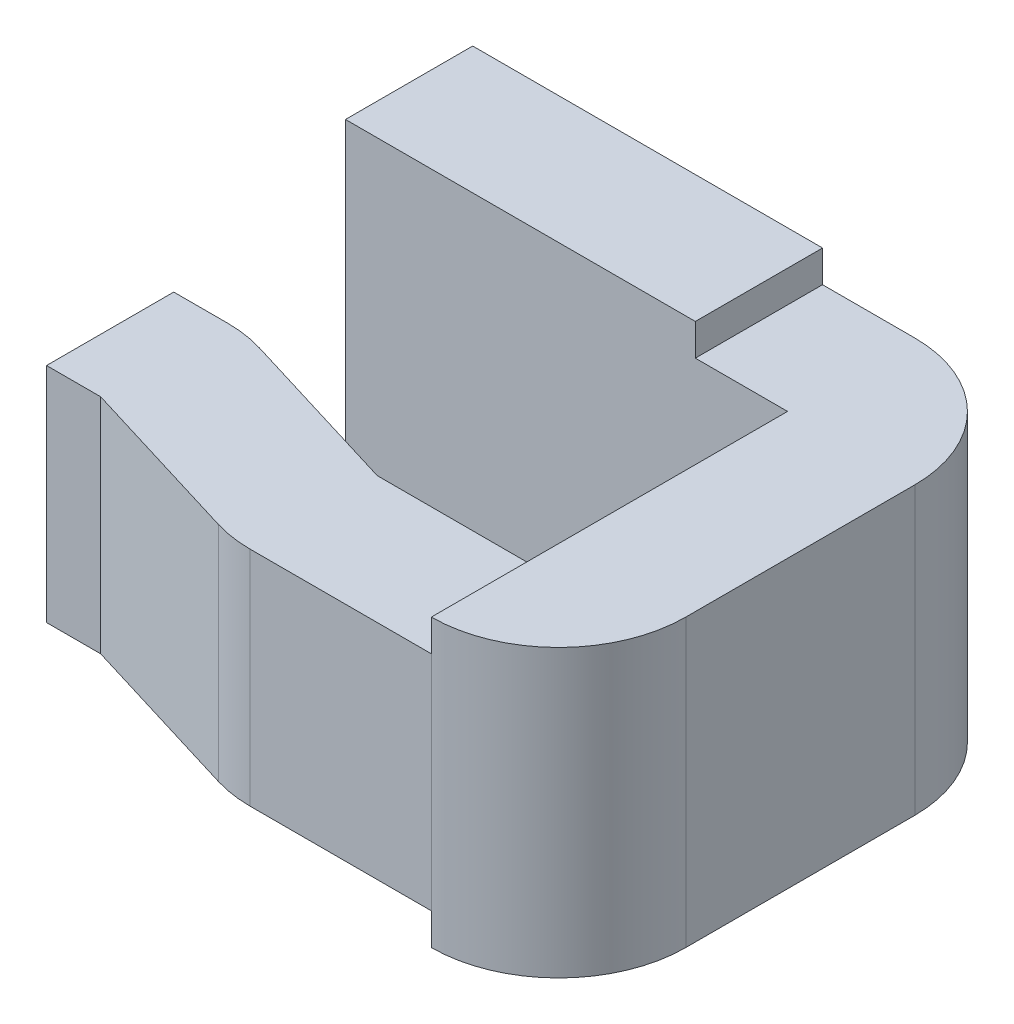
ISO-10303-21;
HEADER;
FILE_DESCRIPTION(('STEP AP214'),'2;1');
FILE_NAME('part.step','',(''),(''),'','','');
FILE_SCHEMA(('AUTOMOTIVE_DESIGN { 1 0 10303 214 1 1 1 1 }'));
ENDSEC;
DATA;
#1=APPLICATION_CONTEXT('core data for automotive mechanical design processes');
#2=APPLICATION_PROTOCOL_DEFINITION('international standard','automotive_design',2000,#1);
#3=PRODUCT_CONTEXT('',#1,'mechanical');
#4=PRODUCT('Part','Part','',(#3));
#5=PRODUCT_RELATED_PRODUCT_CATEGORY('part','',(#4));
#6=PRODUCT_DEFINITION_FORMATION('','',#4);
#7=PRODUCT_DEFINITION_CONTEXT('part definition',#1,'design');
#8=PRODUCT_DEFINITION('design','',#6,#7);
#9=PRODUCT_DEFINITION_SHAPE('','',#8);
#10=(LENGTH_UNIT() NAMED_UNIT(*) SI_UNIT(.MILLI.,.METRE.));
#11=(NAMED_UNIT(*) PLANE_ANGLE_UNIT() SI_UNIT($,.RADIAN.));
#12=(NAMED_UNIT(*) SI_UNIT($,.STERADIAN.) SOLID_ANGLE_UNIT());
#13=UNCERTAINTY_MEASURE_WITH_UNIT(LENGTH_MEASURE(1.E-05),#10,'distance_accuracy_value','');
#14=(GEOMETRIC_REPRESENTATION_CONTEXT(3) GLOBAL_UNCERTAINTY_ASSIGNED_CONTEXT((#13)) GLOBAL_UNIT_ASSIGNED_CONTEXT((#10,
#11,#12)) REPRESENTATION_CONTEXT('',''));
#15=CARTESIAN_POINT('',(0.,0.,0.));
#16=DIRECTION('',(0.,0.,1.));
#17=DIRECTION('',(1.,0.,0.));
#18=AXIS2_PLACEMENT_3D('',#15,#16,#17);
#19=CARTESIAN_POINT('',(1.39,0.55,0.92));
#20=DIRECTION('',(0.,0.,1.));
#21=DIRECTION('',(1.,0.,0.));
#22=AXIS2_PLACEMENT_3D('',#19,#20,#21);
#23=PLANE('',#22);
#24=DIRECTION('',(1.,0.,0.));
#25=VECTOR('',#24,1.);
#26=CARTESIAN_POINT('',(1.39,-0.35,0.92));
#27=LINE('',#26,#25);
#28=CARTESIAN_POINT('',(0.819829800590719,-0.35,0.92));
#29=VERTEX_POINT('',#28);
#30=CARTESIAN_POINT('',(1.39,-0.35,0.92));
#31=VERTEX_POINT('',#30);
#32=EDGE_CURVE('E231',#29,#31,#27,.T.);
#33=ORIENTED_EDGE('',*,*,#32,.F.);
#34=DIRECTION('',(0.,-1.,0.));
#35=VECTOR('',#34,1.);
#36=CARTESIAN_POINT('',(0.819829800590719,0.55,0.92));
#37=LINE('',#36,#35);
#38=CARTESIAN_POINT('',(0.819829800590719,0.35,0.92));
#39=VERTEX_POINT('',#38);
#40=EDGE_CURVE('E159',#39,#29,#37,.T.);
#41=ORIENTED_EDGE('',*,*,#40,.F.);
#42=DIRECTION('',(1.,0.,0.));
#43=VECTOR('',#42,1.);
#44=CARTESIAN_POINT('',(1.39,0.35,0.92));
#45=LINE('',#44,#43);
#46=CARTESIAN_POINT('',(1.39,0.35,0.92));
#47=VERTEX_POINT('',#46);
#48=EDGE_CURVE('E264',#39,#47,#45,.T.);
#49=ORIENTED_EDGE('',*,*,#48,.T.);
#50=DIRECTION('',(0.,-1.,0.));
#51=VECTOR('',#50,1.);
#52=CARTESIAN_POINT('',(1.39,0.55,0.92));
#53=LINE('',#52,#51);
#54=EDGE_CURVE('E163',#47,#31,#53,.T.);
#55=ORIENTED_EDGE('',*,*,#54,.T.);
#56=EDGE_LOOP('',(#33,#41,#49,#55));
#57=FACE_BOUND('',#56,.T.);
#58=ADVANCED_FACE('F39',(#57),#23,.F.);
#59=CARTESIAN_POINT('',(1.39,0.55,1.32));
#60=DIRECTION('',(0.,0.,-1.));
#61=DIRECTION('',(-1.,0.,0.));
#62=AXIS2_PLACEMENT_3D('',#59,#60,#61);
#63=PLANE('',#62);
#64=DIRECTION('',(-1.,0.,0.));
#65=VECTOR('',#64,1.);
#66=CARTESIAN_POINT('',(0.,-0.35,1.32));
#67=LINE('',#66,#65);
#68=CARTESIAN_POINT('',(1.39,-0.35,1.32));
#69=VERTEX_POINT('',#68);
#70=CARTESIAN_POINT('',(0.819829800590718,-0.35,1.32));
#71=VERTEX_POINT('',#70);
#72=EDGE_CURVE('E354',#69,#71,#67,.T.);
#73=ORIENTED_EDGE('',*,*,#72,.F.);
#74=DIRECTION('',(0.,-1.,0.));
#75=VECTOR('',#74,1.);
#76=CARTESIAN_POINT('',(1.39,0.55,1.32));
#77=LINE('',#76,#75);
#78=CARTESIAN_POINT('',(1.39,0.35,1.32));
#79=VERTEX_POINT('',#78);
#80=EDGE_CURVE('E126',#79,#69,#77,.T.);
#81=ORIENTED_EDGE('',*,*,#80,.F.);
#82=DIRECTION('',(-1.,0.,0.));
#83=VECTOR('',#82,1.);
#84=CARTESIAN_POINT('',(0.,0.35,1.32));
#85=LINE('',#84,#83);
#86=CARTESIAN_POINT('',(0.819829800590718,0.35,1.32));
#87=VERTEX_POINT('',#86);
#88=EDGE_CURVE('E236',#79,#87,#85,.T.);
#89=ORIENTED_EDGE('',*,*,#88,.T.);
#90=DIRECTION('',(0.,-1.,0.));
#91=VECTOR('',#90,1.);
#92=CARTESIAN_POINT('',(0.819829800590719,0.55,1.32));
#93=LINE('',#92,#91);
#94=EDGE_CURVE('E131',#87,#71,#93,.T.);
#95=ORIENTED_EDGE('',*,*,#94,.T.);
#96=EDGE_LOOP('',(#73,#81,#89,#95));
#97=FACE_BOUND('',#96,.T.);
#98=ADVANCED_FACE('F352',(#97),#63,.F.);
#99=CARTESIAN_POINT('',(0.819829800590719,0.55,0.92));
#100=DIRECTION('',(-0.291806643089871,0.,0.956477330127913));
#101=DIRECTION('',(0.956477330127913,0.,0.291806643089871));
#102=AXIS2_PLACEMENT_3D('',#99,#100,#101);
#103=PLANE('',#102);
#104=DIRECTION('',(0.956477330127913,0.,0.291806643089871));
#105=VECTOR('',#104,1.);
#106=CARTESIAN_POINT('',(0.819829800590719,-0.35,0.92));
#107=LINE('',#106,#105);
#108=CARTESIAN_POINT('',(0.286892856645232,-0.35,0.757409067948835));
#109=VERTEX_POINT('',#108);
#110=EDGE_CURVE('E227',#109,#29,#107,.T.);
#111=ORIENTED_EDGE('',*,*,#110,.F.);
#112=DIRECTION('',(0.,-1.,0.));
#113=VECTOR('',#112,1.);
#114=CARTESIAN_POINT('',(0.286892856645232,0.55,0.757409067948835));
#115=LINE('',#114,#113);
#116=CARTESIAN_POINT('',(0.286892856645232,0.35,0.757409067948835));
#117=VERTEX_POINT('',#116);
#118=EDGE_CURVE('E155',#117,#109,#115,.T.);
#119=ORIENTED_EDGE('',*,*,#118,.F.);
#120=DIRECTION('',(0.956477330127913,0.,0.291806643089871));
#121=VECTOR('',#120,1.);
#122=CARTESIAN_POINT('',(0.819829800590719,0.35,0.92));
#123=LINE('',#122,#121);
#124=EDGE_CURVE('E260',#117,#39,#123,.T.);
#125=ORIENTED_EDGE('',*,*,#124,.T.);
#126=ORIENTED_EDGE('',*,*,#40,.T.);
#127=EDGE_LOOP('',(#111,#119,#125,#126));
#128=FACE_BOUND('',#127,.T.);
#129=ADVANCED_FACE('F462',(#128),#103,.F.);
#130=CARTESIAN_POINT('',(0.170170199409284,0.55,1.14));
#131=DIRECTION('',(0.,-1.,0.));
#132=DIRECTION('',(0.,0.,-1.));
#133=AXIS2_PLACEMENT_3D('',#130,#131,#132);
#134=CYLINDRICAL_SURFACE('',#133,0.4);
#135=CARTESIAN_POINT('',(0.170170199409284,-0.35,1.14));
#136=DIRECTION('',(0.,-1.,0.));
#137=DIRECTION('',(1.,0.,0.));
#138=AXIS2_PLACEMENT_3D('',#135,#136,#137);
#139=CIRCLE('',#138,0.4);
#140=CARTESIAN_POINT('',(0.170170199409284,-0.35,0.74));
#141=VERTEX_POINT('',#140);
#142=EDGE_CURVE('E217',#141,#109,#139,.T.);
#143=ORIENTED_EDGE('',*,*,#142,.F.);
#144=DIRECTION('',(0.,-1.,0.));
#145=VECTOR('',#144,1.);
#146=CARTESIAN_POINT('',(0.170170199409284,0.55,0.74));
#147=LINE('',#146,#145);
#148=CARTESIAN_POINT('',(0.170170199409284,0.35,0.74));
#149=VERTEX_POINT('',#148);
#150=EDGE_CURVE('E151',#149,#141,#147,.T.);
#151=ORIENTED_EDGE('',*,*,#150,.F.);
#152=CARTESIAN_POINT('',(0.170170199409284,0.35,1.14));
#153=DIRECTION('',(0.,-1.,0.));
#154=DIRECTION('',(1.,0.,0.));
#155=AXIS2_PLACEMENT_3D('',#152,#153,#154);
#156=CIRCLE('',#155,0.4);
#157=EDGE_CURVE('E256',#149,#117,#156,.T.);
#158=ORIENTED_EDGE('',*,*,#157,.T.);
#159=ORIENTED_EDGE('',*,*,#118,.T.);
#160=EDGE_LOOP('',(#143,#151,#158,#159));
#161=FACE_BOUND('',#160,.T.);
#162=ADVANCED_FACE('F467',(#161),#134,.T.);
#163=CARTESIAN_POINT('',(0.170170199409284,0.55,0.74));
#164=DIRECTION('',(0.,0.,1.));
#165=DIRECTION('',(1.,0.,0.));
#166=AXIS2_PLACEMENT_3D('',#163,#164,#165);
#167=PLANE('',#166);
#168=DIRECTION('',(-1.,0.,0.));
#169=VECTOR('',#168,1.);
#170=CARTESIAN_POINT('',(0.,-0.35,0.74));
#171=LINE('',#170,#169);
#172=CARTESIAN_POINT('',(0.,-0.35,0.74));
#173=VERTEX_POINT('',#172);
#174=EDGE_CURVE('E472',#141,#173,#171,.T.);
#175=ORIENTED_EDGE('',*,*,#174,.T.);
#176=DIRECTION('',(0.,-1.,0.));
#177=VECTOR('',#176,1.);
#178=CARTESIAN_POINT('',(0.,0.55,0.74));
#179=LINE('',#178,#177);
#180=CARTESIAN_POINT('',(0.,0.35,0.74));
#181=VERTEX_POINT('',#180);
#182=EDGE_CURVE('E147',#181,#173,#179,.T.);
#183=ORIENTED_EDGE('',*,*,#182,.F.);
#184=DIRECTION('',(-1.,0.,0.));
#185=VECTOR('',#184,1.);
#186=CARTESIAN_POINT('',(0.,0.35,0.74));
#187=LINE('',#186,#185);
#188=EDGE_CURVE('E235',#149,#181,#187,.T.);
#189=ORIENTED_EDGE('',*,*,#188,.F.);
#190=ORIENTED_EDGE('',*,*,#150,.T.);
#191=EDGE_LOOP('',(#175,#183,#189,#190));
#192=FACE_BOUND('',#191,.T.);
#193=ADVANCED_FACE('F470',(#192),#167,.F.);
#194=CARTESIAN_POINT('',(0.,0.55,0.74));
#195=DIRECTION('',(1.,0.,0.));
#196=DIRECTION('',(0.,0.,-1.));
#197=AXIS2_PLACEMENT_3D('',#194,#195,#196);
#198=PLANE('',#197);
#199=DIRECTION('',(0.,0.,-1.));
#200=VECTOR('',#199,1.);
#201=CARTESIAN_POINT('',(0.,-0.35,1.32));
#202=LINE('',#201,#200);
#203=CARTESIAN_POINT('',(0.,-0.35,1.14));
#204=VERTEX_POINT('',#203);
#205=EDGE_CURVE('E220',#204,#173,#202,.T.);
#206=ORIENTED_EDGE('',*,*,#205,.F.);
#207=DIRECTION('',(0.,-1.,0.));
#208=VECTOR('',#207,1.);
#209=CARTESIAN_POINT('',(0.,0.55,1.14));
#210=LINE('',#209,#208);
#211=CARTESIAN_POINT('',(0.,0.35,1.14));
#212=VERTEX_POINT('',#211);
#213=EDGE_CURVE('E143',#212,#204,#210,.T.);
#214=ORIENTED_EDGE('',*,*,#213,.F.);
#215=DIRECTION('',(0.,0.,-1.));
#216=VECTOR('',#215,1.);
#217=CARTESIAN_POINT('',(0.,0.35,1.32));
#218=LINE('',#217,#216);
#219=EDGE_CURVE('E243',#212,#181,#218,.T.);
#220=ORIENTED_EDGE('',*,*,#219,.T.);
#221=ORIENTED_EDGE('',*,*,#182,.T.);
#222=EDGE_LOOP('',(#206,#214,#220,#221));
#223=FACE_BOUND('',#222,.T.);
#224=ADVANCED_FACE('F476',(#223),#198,.F.);
#225=CARTESIAN_POINT('',(0.170170199409284,0.55,1.14));
#226=DIRECTION('',(0.,0.,-1.));
#227=DIRECTION('',(-1.,0.,0.));
#228=AXIS2_PLACEMENT_3D('',#225,#226,#227);
#229=PLANE('',#228);
#230=DIRECTION('',(-1.,0.,0.));
#231=VECTOR('',#230,1.);
#232=CARTESIAN_POINT('',(0.170170199409284,-0.35,1.14));
#233=LINE('',#232,#231);
#234=CARTESIAN_POINT('',(0.170170199409284,-0.35,1.14));
#235=VERTEX_POINT('',#234);
#236=EDGE_CURVE('E212',#235,#204,#233,.T.);
#237=ORIENTED_EDGE('',*,*,#236,.F.);
#238=DIRECTION('',(0.,-1.,0.));
#239=VECTOR('',#238,1.);
#240=CARTESIAN_POINT('',(0.170170199409284,0.55,1.14));
#241=LINE('',#240,#239);
#242=CARTESIAN_POINT('',(0.170170199409284,0.35,1.14));
#243=VERTEX_POINT('',#242);
#244=EDGE_CURVE('E139',#243,#235,#241,.T.);
#245=ORIENTED_EDGE('',*,*,#244,.F.);
#246=DIRECTION('',(-1.,0.,0.));
#247=VECTOR('',#246,1.);
#248=CARTESIAN_POINT('',(0.170170199409284,0.35,1.14));
#249=LINE('',#248,#247);
#250=EDGE_CURVE('E252',#243,#212,#249,.T.);
#251=ORIENTED_EDGE('',*,*,#250,.T.);
#252=ORIENTED_EDGE('',*,*,#213,.T.);
#253=EDGE_LOOP('',(#237,#245,#251,#252));
#254=FACE_BOUND('',#253,.T.);
#255=ADVANCED_FACE('F479',(#254),#229,.F.);
#256=CARTESIAN_POINT('',(0.70310714335477,0.55,1.30259093205117));
#257=DIRECTION('',(0.291806643089871,0.,-0.956477330127913));
#258=DIRECTION('',(-0.956477330127913,0.,-0.291806643089871));
#259=AXIS2_PLACEMENT_3D('',#256,#257,#258);
#260=PLANE('',#259);
#261=DIRECTION('',(-0.956477330127913,0.,-0.291806643089871));
#262=VECTOR('',#261,1.);
#263=CARTESIAN_POINT('',(0.703107143354771,-0.35,1.30259093205117));
#264=LINE('',#263,#262);
#265=CARTESIAN_POINT('',(0.70310714335477,-0.35,1.30259093205117));
#266=VERTEX_POINT('',#265);
#267=EDGE_CURVE('E204',#266,#235,#264,.T.);
#268=ORIENTED_EDGE('',*,*,#267,.F.);
#269=DIRECTION('',(0.,-1.,0.));
#270=VECTOR('',#269,1.);
#271=CARTESIAN_POINT('',(0.70310714335477,0.55,1.30259093205117));
#272=LINE('',#271,#270);
#273=CARTESIAN_POINT('',(0.70310714335477,0.35,1.30259093205117));
#274=VERTEX_POINT('',#273);
#275=EDGE_CURVE('E135',#274,#266,#272,.T.);
#276=ORIENTED_EDGE('',*,*,#275,.F.);
#277=DIRECTION('',(-0.956477330127913,0.,-0.291806643089871));
#278=VECTOR('',#277,1.);
#279=CARTESIAN_POINT('',(0.70310714335477,0.35,1.30259093205117));
#280=LINE('',#279,#278);
#281=EDGE_CURVE('E201',#274,#243,#280,.T.);
#282=ORIENTED_EDGE('',*,*,#281,.T.);
#283=ORIENTED_EDGE('',*,*,#244,.T.);
#284=EDGE_LOOP('',(#268,#276,#282,#283));
#285=FACE_BOUND('',#284,.T.);
#286=ADVANCED_FACE('F200',(#285),#260,.F.);
#287=CARTESIAN_POINT('',(0.819829800590719,0.55,0.92));
#288=DIRECTION('',(0.,-1.,0.));
#289=DIRECTION('',(0.,0.,-1.));
#290=AXIS2_PLACEMENT_3D('',#287,#288,#289);
#291=CYLINDRICAL_SURFACE('',#290,0.4);
#292=CARTESIAN_POINT('',(0.819829800590719,-0.35,0.92));
#293=DIRECTION('',(0.,-1.,0.));
#294=DIRECTION('',(1.,0.,0.));
#295=AXIS2_PLACEMENT_3D('',#292,#293,#294);
#296=CIRCLE('',#295,0.4);
#297=EDGE_CURVE('E11',#71,#266,#296,.T.);
#298=ORIENTED_EDGE('',*,*,#297,.F.);
#299=ORIENTED_EDGE('',*,*,#94,.F.);
#300=CARTESIAN_POINT('',(0.819829800590719,0.35,0.92));
#301=DIRECTION('',(0.,-1.,0.));
#302=DIRECTION('',(1.,0.,0.));
#303=AXIS2_PLACEMENT_3D('',#300,#301,#302);
#304=CIRCLE('',#303,0.4);
#305=EDGE_CURVE('E48',#87,#274,#304,.T.);
#306=ORIENTED_EDGE('',*,*,#305,.T.);
#307=ORIENTED_EDGE('',*,*,#275,.T.);
#308=EDGE_LOOP('',(#298,#299,#306,#307));
#309=FACE_BOUND('',#308,.T.);
#310=ADVANCED_FACE('F187',(#309),#291,.T.);
#311=CARTESIAN_POINT('',(1.1,-0.45,1.32));
#312=DIRECTION('',(0.,-1.,0.));
#313=DIRECTION('',(1.,0.,0.));
#314=AXIS2_PLACEMENT_3D('',#311,#312,#313);
#315=PLANE('',#314);
#316=CARTESIAN_POINT('',(1.39,-0.45,0.92));
#317=DIRECTION('',(0.,-1.,0.));
#318=DIRECTION('',(1.,0.,0.));
#319=AXIS2_PLACEMENT_3D('',#316,#317,#318);
#320=CIRCLE('',#319,0.4);
#321=CARTESIAN_POINT('',(1.79,-0.45,0.92));
#322=VERTEX_POINT('',#321);
#323=CARTESIAN_POINT('',(1.39,-0.45,1.32));
#324=VERTEX_POINT('',#323);
#325=EDGE_CURVE('E289',#322,#324,#320,.T.);
#326=ORIENTED_EDGE('',*,*,#325,.T.);
#327=DIRECTION('',(0.,0.,-1.));
#328=VECTOR('',#327,1.);
#329=CARTESIAN_POINT('',(1.39,-0.45,0.2));
#330=LINE('',#329,#328);
#331=CARTESIAN_POINT('',(1.39,-0.45,0.2));
#332=VERTEX_POINT('',#331);
#333=EDGE_CURVE('E293',#324,#332,#330,.T.);
#334=ORIENTED_EDGE('',*,*,#333,.T.);
#335=DIRECTION('',(-1.,0.,0.));
#336=VECTOR('',#335,1.);
#337=CARTESIAN_POINT('',(0.,-0.45,0.2));
#338=LINE('',#337,#336);
#339=CARTESIAN_POINT('',(1.1,-0.45,0.2));
#340=VERTEX_POINT('',#339);
#341=EDGE_CURVE('E297',#332,#340,#338,.T.);
#342=ORIENTED_EDGE('',*,*,#341,.T.);
#343=DIRECTION('',(0.,0.,-1.));
#344=VECTOR('',#343,1.);
#345=CARTESIAN_POINT('',(1.1,-0.45,1.32));
#346=LINE('',#345,#344);
#347=CARTESIAN_POINT('',(1.1,-0.45,-0.2));
#348=VERTEX_POINT('',#347);
#349=EDGE_CURVE('E273',#340,#348,#346,.T.);
#350=ORIENTED_EDGE('',*,*,#349,.T.);
#351=DIRECTION('',(-1.,0.,0.));
#352=VECTOR('',#351,1.);
#353=CARTESIAN_POINT('',(1.1,-0.45,-0.2));
#354=LINE('',#353,#352);
#355=CARTESIAN_POINT('',(1.39,-0.45,-0.2));
#356=VERTEX_POINT('',#355);
#357=EDGE_CURVE('E270',#356,#348,#354,.T.);
#358=ORIENTED_EDGE('',*,*,#357,.F.);
#359=CARTESIAN_POINT('',(1.39,-0.45,0.2));
#360=DIRECTION('',(0.,-1.,0.));
#361=DIRECTION('',(1.,0.,0.));
#362=AXIS2_PLACEMENT_3D('',#359,#360,#361);
#363=CIRCLE('',#362,0.4);
#364=CARTESIAN_POINT('',(1.79,-0.45,0.2));
#365=VERTEX_POINT('',#364);
#366=EDGE_CURVE('E281',#356,#365,#363,.T.);
#367=ORIENTED_EDGE('',*,*,#366,.T.);
#368=DIRECTION('',(0.,0.,1.));
#369=VECTOR('',#368,1.);
#370=CARTESIAN_POINT('',(1.79,-0.45,0.2));
#371=LINE('',#370,#369);
#372=EDGE_CURVE('E285',#365,#322,#371,.T.);
#373=ORIENTED_EDGE('',*,*,#372,.T.);
#374=EDGE_LOOP('',(#326,#334,#342,#350,#358,#367,#373));
#375=FACE_BOUND('',#374,.T.);
#376=ADVANCED_FACE('F428',(#375),#315,.T.);
#377=CARTESIAN_POINT('',(0.,0.55,0.2));
#378=DIRECTION('',(0.,0.,-1.));
#379=DIRECTION('',(-1.,0.,0.));
#380=AXIS2_PLACEMENT_3D('',#377,#378,#379);
#381=PLANE('',#380);
#382=DIRECTION('',(0.,-1.,0.));
#383=VECTOR('',#382,1.);
#384=CARTESIAN_POINT('',(1.1,0.55,0.2));
#385=LINE('',#384,#383);
#386=CARTESIAN_POINT('',(1.1,-0.55,0.2));
#387=VERTEX_POINT('',#386);
#388=EDGE_CURVE('E277',#340,#387,#385,.T.);
#389=ORIENTED_EDGE('',*,*,#388,.F.);
#390=ORIENTED_EDGE('',*,*,#341,.F.);
#391=DIRECTION('',(0.,-1.,0.));
#392=VECTOR('',#391,1.);
#393=CARTESIAN_POINT('',(1.39,0.55,0.2));
#394=LINE('',#393,#392);
#395=CARTESIAN_POINT('',(1.39,0.45,0.2));
#396=VERTEX_POINT('',#395);
#397=EDGE_CURVE('E167',#396,#332,#394,.T.);
#398=ORIENTED_EDGE('',*,*,#397,.F.);
#399=DIRECTION('',(-1.,0.,0.));
#400=VECTOR('',#399,1.);
#401=CARTESIAN_POINT('',(0.,0.45,0.2));
#402=LINE('',#401,#400);
#403=CARTESIAN_POINT('',(1.1,0.45,0.2));
#404=VERTEX_POINT('',#403);
#405=EDGE_CURVE('E104',#396,#404,#402,.T.);
#406=ORIENTED_EDGE('',*,*,#405,.T.);
#407=DIRECTION('',(0.,1.,0.));
#408=VECTOR('',#407,1.);
#409=CARTESIAN_POINT('',(1.1,0.55,0.2));
#410=LINE('',#409,#408);
#411=CARTESIAN_POINT('',(1.1,0.55,0.2));
#412=VERTEX_POINT('',#411);
#413=EDGE_CURVE('E310',#404,#412,#410,.T.);
#414=ORIENTED_EDGE('',*,*,#413,.T.);
#415=DIRECTION('',(1.,0.,0.));
#416=VECTOR('',#415,1.);
#417=CARTESIAN_POINT('',(0.,0.55,0.2));
#418=LINE('',#417,#416);
#419=CARTESIAN_POINT('',(0.,0.55,0.2));
#420=VERTEX_POINT('',#419);
#421=EDGE_CURVE('E330',#420,#412,#418,.T.);
#422=ORIENTED_EDGE('',*,*,#421,.F.);
#423=DIRECTION('',(0.,-1.,0.));
#424=VECTOR('',#423,1.);
#425=CARTESIAN_POINT('',(0.,0.55,0.2));
#426=LINE('',#425,#424);
#427=CARTESIAN_POINT('',(0.,-0.55,0.2));
#428=VERTEX_POINT('',#427);
#429=EDGE_CURVE('E171',#420,#428,#426,.T.);
#430=ORIENTED_EDGE('',*,*,#429,.T.);
#431=DIRECTION('',(1.,0.,0.));
#432=VECTOR('',#431,1.);
#433=CARTESIAN_POINT('',(0.,-0.55,0.2));
#434=LINE('',#433,#432);
#435=EDGE_CURVE('E91',#428,#387,#434,.T.);
#436=ORIENTED_EDGE('',*,*,#435,.T.);
#437=EDGE_LOOP('',(#389,#390,#398,#406,#414,#422,#430,#436));
#438=FACE_BOUND('',#437,.T.);
#439=ADVANCED_FACE('F425',(#438),#381,.F.);
#440=CARTESIAN_POINT('',(1.39,0.55,0.2));
#441=DIRECTION('',(1.,0.,0.));
#442=DIRECTION('',(0.,0.,-1.));
#443=AXIS2_PLACEMENT_3D('',#440,#441,#442);
#444=PLANE('',#443);
#445=ORIENTED_EDGE('',*,*,#333,.F.);
#446=DIRECTION('',(0.,1.,0.));
#447=VECTOR('',#446,1.);
#448=CARTESIAN_POINT('',(1.39,-0.35,1.32));
#449=LINE('',#448,#447);
#450=EDGE_CURVE('E345',#324,#69,#449,.T.);
#451=ORIENTED_EDGE('',*,*,#450,.T.);
#452=DIRECTION('',(0.,0.,-1.));
#453=VECTOR('',#452,1.);
#454=CARTESIAN_POINT('',(1.39,-0.35,1.32));
#455=LINE('',#454,#453);
#456=EDGE_CURVE('E213',#69,#31,#455,.T.);
#457=ORIENTED_EDGE('',*,*,#456,.T.);
#458=ORIENTED_EDGE('',*,*,#54,.F.);
#459=DIRECTION('',(0.,0.,-1.));
#460=VECTOR('',#459,1.);
#461=CARTESIAN_POINT('',(1.39,0.35,1.32));
#462=LINE('',#461,#460);
#463=EDGE_CURVE('E239',#79,#47,#462,.T.);
#464=ORIENTED_EDGE('',*,*,#463,.F.);
#465=CARTESIAN_POINT('',(1.39,0.45,1.32));
#466=VERTEX_POINT('',#465);
#467=EDGE_CURVE('E127',#466,#79,#77,.T.);
#468=ORIENTED_EDGE('',*,*,#467,.F.);
#469=DIRECTION('',(0.,0.,-1.));
#470=VECTOR('',#469,1.);
#471=CARTESIAN_POINT('',(1.39,0.45,0.2));
#472=LINE('',#471,#470);
#473=EDGE_CURVE('E110',#466,#396,#472,.T.);
#474=ORIENTED_EDGE('',*,*,#473,.T.);
#475=ORIENTED_EDGE('',*,*,#397,.T.);
#476=EDGE_LOOP('',(#445,#451,#457,#458,#464,#468,#474,#475));
#477=FACE_BOUND('',#476,.T.);
#478=ADVANCED_FACE('F417',(#477),#444,.F.);
#479=CARTESIAN_POINT('',(1.39,0.55,0.92));
#480=DIRECTION('',(0.,-1.,0.));
#481=DIRECTION('',(0.,0.,-1.));
#482=AXIS2_PLACEMENT_3D('',#479,#480,#481);
#483=CYLINDRICAL_SURFACE('',#482,0.4);
#484=ORIENTED_EDGE('',*,*,#325,.F.);
#485=DIRECTION('',(0.,-1.,0.));
#486=VECTOR('',#485,1.);
#487=CARTESIAN_POINT('',(1.79,0.55,0.92));
#488=LINE('',#487,#486);
#489=CARTESIAN_POINT('',(1.79,0.45,0.92));
#490=VERTEX_POINT('',#489);
#491=EDGE_CURVE('E122',#490,#322,#488,.T.);
#492=ORIENTED_EDGE('',*,*,#491,.F.);
#493=CARTESIAN_POINT('',(1.39,0.45,0.92));
#494=DIRECTION('',(0.,-1.,0.));
#495=DIRECTION('',(1.,0.,0.));
#496=AXIS2_PLACEMENT_3D('',#493,#494,#495);
#497=CIRCLE('',#496,0.4);
#498=EDGE_CURVE('E322',#490,#466,#497,.T.);
#499=ORIENTED_EDGE('',*,*,#498,.T.);
#500=ORIENTED_EDGE('',*,*,#467,.T.);
#501=ORIENTED_EDGE('',*,*,#80,.T.);
#502=ORIENTED_EDGE('',*,*,#450,.F.);
#503=EDGE_LOOP('',(#484,#492,#499,#500,#501,#502));
#504=FACE_BOUND('',#503,.T.);
#505=ADVANCED_FACE('F342',(#504),#483,.T.);
#506=CARTESIAN_POINT('',(1.79,0.55,0.2));
#507=DIRECTION('',(-1.,0.,0.));
#508=DIRECTION('',(0.,0.,1.));
#509=AXIS2_PLACEMENT_3D('',#506,#507,#508);
#510=PLANE('',#509);
#511=ORIENTED_EDGE('',*,*,#372,.F.);
#512=DIRECTION('',(0.,-1.,0.));
#513=VECTOR('',#512,1.);
#514=CARTESIAN_POINT('',(1.79,0.55,0.2));
#515=LINE('',#514,#513);
#516=CARTESIAN_POINT('',(1.79,0.45,0.2));
#517=VERTEX_POINT('',#516);
#518=EDGE_CURVE('E118',#517,#365,#515,.T.);
#519=ORIENTED_EDGE('',*,*,#518,.F.);
#520=DIRECTION('',(0.,0.,1.));
#521=VECTOR('',#520,1.);
#522=CARTESIAN_POINT('',(1.79,0.45,0.2));
#523=LINE('',#522,#521);
#524=EDGE_CURVE('E318',#517,#490,#523,.T.);
#525=ORIENTED_EDGE('',*,*,#524,.T.);
#526=ORIENTED_EDGE('',*,*,#491,.T.);
#527=EDGE_LOOP('',(#511,#519,#525,#526));
#528=FACE_BOUND('',#527,.T.);
#529=ADVANCED_FACE('F439',(#528),#510,.F.);
#530=CARTESIAN_POINT('',(1.39,0.55,0.2));
#531=DIRECTION('',(0.,-1.,0.));
#532=DIRECTION('',(0.,0.,-1.));
#533=AXIS2_PLACEMENT_3D('',#530,#531,#532);
#534=CYLINDRICAL_SURFACE('',#533,0.4);
#535=ORIENTED_EDGE('',*,*,#366,.F.);
#536=DIRECTION('',(0.,-1.,0.));
#537=VECTOR('',#536,1.);
#538=CARTESIAN_POINT('',(1.39,0.55,-0.2));
#539=LINE('',#538,#537);
#540=CARTESIAN_POINT('',(1.39,0.45,-0.2));
#541=VERTEX_POINT('',#540);
#542=EDGE_CURVE('E98',#541,#356,#539,.T.);
#543=ORIENTED_EDGE('',*,*,#542,.F.);
#544=CARTESIAN_POINT('',(1.39,0.45,0.2));
#545=DIRECTION('',(0.,-1.,0.));
#546=DIRECTION('',(1.,0.,0.));
#547=AXIS2_PLACEMENT_3D('',#544,#545,#546);
#548=CIRCLE('',#547,0.4);
#549=EDGE_CURVE('E314',#541,#517,#548,.T.);
#550=ORIENTED_EDGE('',*,*,#549,.T.);
#551=ORIENTED_EDGE('',*,*,#518,.T.);
#552=EDGE_LOOP('',(#535,#543,#550,#551));
#553=FACE_BOUND('',#552,.T.);
#554=ADVANCED_FACE('F436',(#553),#534,.T.);
#555=CARTESIAN_POINT('',(0.,0.55,-0.2));
#556=DIRECTION('',(0.,0.,1.));
#557=DIRECTION('',(1.,0.,0.));
#558=AXIS2_PLACEMENT_3D('',#555,#556,#557);
#559=PLANE('',#558);
#560=DIRECTION('',(0.,-1.,0.));
#561=VECTOR('',#560,1.);
#562=CARTESIAN_POINT('',(1.1,-0.55,-0.2));
#563=LINE('',#562,#561);
#564=CARTESIAN_POINT('',(1.1,-0.55,-0.2));
#565=VERTEX_POINT('',#564);
#566=EDGE_CURVE('E85',#348,#565,#563,.T.);
#567=ORIENTED_EDGE('',*,*,#566,.T.);
#568=DIRECTION('',(-1.,0.,0.));
#569=VECTOR('',#568,1.);
#570=CARTESIAN_POINT('',(0.,-0.55,-0.2));
#571=LINE('',#570,#569);
#572=CARTESIAN_POINT('',(0.,-0.55,-0.2));
#573=VERTEX_POINT('',#572);
#574=EDGE_CURVE('E77',#565,#573,#571,.T.);
#575=ORIENTED_EDGE('',*,*,#574,.T.);
#576=DIRECTION('',(0.,-1.,0.));
#577=VECTOR('',#576,1.);
#578=CARTESIAN_POINT('',(0.,0.55,-0.2));
#579=LINE('',#578,#577);
#580=CARTESIAN_POINT('',(0.,0.55,-0.2));
#581=VERTEX_POINT('',#580);
#582=EDGE_CURVE('E80',#581,#573,#579,.T.);
#583=ORIENTED_EDGE('',*,*,#582,.F.);
#584=DIRECTION('',(-1.,0.,0.));
#585=VECTOR('',#584,1.);
#586=CARTESIAN_POINT('',(0.,0.55,-0.2));
#587=LINE('',#586,#585);
#588=CARTESIAN_POINT('',(1.1,0.55,-0.2));
#589=VERTEX_POINT('',#588);
#590=EDGE_CURVE('E63',#589,#581,#587,.T.);
#591=ORIENTED_EDGE('',*,*,#590,.F.);
#592=DIRECTION('',(0.,1.,0.));
#593=VECTOR('',#592,1.);
#594=CARTESIAN_POINT('',(1.1,0.55,-0.2));
#595=LINE('',#594,#593);
#596=CARTESIAN_POINT('',(1.1,0.45,-0.2));
#597=VERTEX_POINT('',#596);
#598=EDGE_CURVE('E55',#597,#589,#595,.T.);
#599=ORIENTED_EDGE('',*,*,#598,.F.);
#600=DIRECTION('',(-1.,0.,0.));
#601=VECTOR('',#600,1.);
#602=CARTESIAN_POINT('',(1.1,0.45,-0.2));
#603=LINE('',#602,#601);
#604=EDGE_CURVE('E303',#541,#597,#603,.T.);
#605=ORIENTED_EDGE('',*,*,#604,.F.);
#606=ORIENTED_EDGE('',*,*,#542,.T.);
#607=ORIENTED_EDGE('',*,*,#357,.T.);
#608=EDGE_LOOP('',(#567,#575,#583,#591,#599,#605,#606,#607));
#609=FACE_BOUND('',#608,.T.);
#610=ADVANCED_FACE('F79',(#609),#559,.F.);
#611=CARTESIAN_POINT('',(1.39,-0.55,0.2));
#612=DIRECTION('',(0.,-1.,0.));
#613=DIRECTION('',(0.,0.,-1.));
#614=AXIS2_PLACEMENT_3D('',#611,#612,#613);
#615=PLANE('',#614);
#616=ORIENTED_EDGE('',*,*,#574,.F.);
#617=DIRECTION('',(0.,0.,1.));
#618=VECTOR('',#617,1.);
#619=CARTESIAN_POINT('',(1.1,-0.55,0.2));
#620=LINE('',#619,#618);
#621=EDGE_CURVE('E177',#565,#387,#620,.T.);
#622=ORIENTED_EDGE('',*,*,#621,.T.);
#623=ORIENTED_EDGE('',*,*,#435,.F.);
#624=DIRECTION('',(0.,0.,1.));
#625=VECTOR('',#624,1.);
#626=CARTESIAN_POINT('',(0.,-0.55,0.2));
#627=LINE('',#626,#625);
#628=EDGE_CURVE('E96',#573,#428,#627,.T.);
#629=ORIENTED_EDGE('',*,*,#628,.F.);
#630=EDGE_LOOP('',(#616,#622,#623,#629));
#631=FACE_BOUND('',#630,.T.);
#632=ADVANCED_FACE('F100',(#631),#615,.T.);
#633=CARTESIAN_POINT('',(0.,0.55,0.2));
#634=DIRECTION('',(1.,0.,0.));
#635=DIRECTION('',(0.,0.,-1.));
#636=AXIS2_PLACEMENT_3D('',#633,#634,#635);
#637=PLANE('',#636);
#638=ORIENTED_EDGE('',*,*,#628,.T.);
#639=ORIENTED_EDGE('',*,*,#429,.F.);
#640=DIRECTION('',(0.,0.,1.));
#641=VECTOR('',#640,1.);
#642=CARTESIAN_POINT('',(0.,0.55,0.2));
#643=LINE('',#642,#641);
#644=EDGE_CURVE('E90',#581,#420,#643,.T.);
#645=ORIENTED_EDGE('',*,*,#644,.F.);
#646=ORIENTED_EDGE('',*,*,#582,.T.);
#647=EDGE_LOOP('',(#638,#639,#645,#646));
#648=FACE_BOUND('',#647,.T.);
#649=ADVANCED_FACE('F41',(#648),#637,.F.);
#650=CARTESIAN_POINT('',(1.39,0.55,0.2));
#651=DIRECTION('',(0.,-1.,0.));
#652=DIRECTION('',(0.,0.,-1.));
#653=AXIS2_PLACEMENT_3D('',#650,#651,#652);
#654=PLANE('',#653);
#655=ORIENTED_EDGE('',*,*,#421,.T.);
#656=DIRECTION('',(0.,0.,-1.));
#657=VECTOR('',#656,1.);
#658=CARTESIAN_POINT('',(1.1,0.55,0.2));
#659=LINE('',#658,#657);
#660=EDGE_CURVE('E174',#412,#589,#659,.T.);
#661=ORIENTED_EDGE('',*,*,#660,.T.);
#662=ORIENTED_EDGE('',*,*,#590,.T.);
#663=ORIENTED_EDGE('',*,*,#644,.T.);
#664=EDGE_LOOP('',(#655,#661,#662,#663));
#665=FACE_BOUND('',#664,.T.);
#666=ADVANCED_FACE('F522',(#665),#654,.F.);
#667=CARTESIAN_POINT('',(1.1,0.45,1.32));
#668=DIRECTION('',(0.,-1.,0.));
#669=DIRECTION('',(1.,0.,0.));
#670=AXIS2_PLACEMENT_3D('',#667,#668,#669);
#671=PLANE('',#670);
#672=ORIENTED_EDGE('',*,*,#473,.F.);
#673=ORIENTED_EDGE('',*,*,#498,.F.);
#674=ORIENTED_EDGE('',*,*,#524,.F.);
#675=ORIENTED_EDGE('',*,*,#549,.F.);
#676=ORIENTED_EDGE('',*,*,#604,.T.);
#677=DIRECTION('',(0.,0.,-1.));
#678=VECTOR('',#677,1.);
#679=CARTESIAN_POINT('',(1.1,0.45,1.32));
#680=LINE('',#679,#678);
#681=EDGE_CURVE('E307',#404,#597,#680,.T.);
#682=ORIENTED_EDGE('',*,*,#681,.F.);
#683=ORIENTED_EDGE('',*,*,#405,.F.);
#684=EDGE_LOOP('',(#672,#673,#674,#675,#676,#682,#683));
#685=FACE_BOUND('',#684,.T.);
#686=ADVANCED_FACE('F421',(#685),#671,.F.);
#687=CARTESIAN_POINT('',(1.1,0.55,1.32));
#688=DIRECTION('',(-1.,0.,0.));
#689=DIRECTION('',(0.,0.,1.));
#690=AXIS2_PLACEMENT_3D('',#687,#688,#689);
#691=PLANE('',#690);
#692=ORIENTED_EDGE('',*,*,#681,.T.);
#693=ORIENTED_EDGE('',*,*,#598,.T.);
#694=ORIENTED_EDGE('',*,*,#660,.F.);
#695=ORIENTED_EDGE('',*,*,#413,.F.);
#696=EDGE_LOOP('',(#692,#693,#694,#695));
#697=FACE_BOUND('',#696,.T.);
#698=ADVANCED_FACE('F519',(#697),#691,.F.);
#699=CARTESIAN_POINT('',(1.1,-0.55,1.32));
#700=DIRECTION('',(1.,0.,0.));
#701=DIRECTION('',(0.,0.,-1.));
#702=AXIS2_PLACEMENT_3D('',#699,#700,#701);
#703=PLANE('',#702);
#704=ORIENTED_EDGE('',*,*,#388,.T.);
#705=ORIENTED_EDGE('',*,*,#621,.F.);
#706=ORIENTED_EDGE('',*,*,#566,.F.);
#707=ORIENTED_EDGE('',*,*,#349,.F.);
#708=EDGE_LOOP('',(#704,#705,#706,#707));
#709=FACE_BOUND('',#708,.T.);
#710=ADVANCED_FACE('F430',(#709),#703,.T.);
#711=CARTESIAN_POINT('',(0.,0.35,1.32));
#712=DIRECTION('',(0.,-1.,0.));
#713=DIRECTION('',(1.,0.,0.));
#714=AXIS2_PLACEMENT_3D('',#711,#712,#713);
#715=PLANE('',#714);
#716=ORIENTED_EDGE('',*,*,#124,.F.);
#717=ORIENTED_EDGE('',*,*,#157,.F.);
#718=ORIENTED_EDGE('',*,*,#188,.T.);
#719=ORIENTED_EDGE('',*,*,#219,.F.);
#720=ORIENTED_EDGE('',*,*,#250,.F.);
#721=ORIENTED_EDGE('',*,*,#281,.F.);
#722=ORIENTED_EDGE('',*,*,#305,.F.);
#723=ORIENTED_EDGE('',*,*,#88,.F.);
#724=ORIENTED_EDGE('',*,*,#463,.T.);
#725=ORIENTED_EDGE('',*,*,#48,.F.);
#726=EDGE_LOOP('',(#716,#717,#718,#719,#720,#721,#722,#723,#724,#725));
#727=FACE_BOUND('',#726,.T.);
#728=ADVANCED_FACE('F463',(#727),#715,.F.);
#729=CARTESIAN_POINT('',(0.,-0.35,1.32));
#730=DIRECTION('',(0.,-1.,0.));
#731=DIRECTION('',(1.,0.,0.));
#732=AXIS2_PLACEMENT_3D('',#729,#730,#731);
#733=PLANE('',#732);
#734=ORIENTED_EDGE('',*,*,#32,.T.);
#735=ORIENTED_EDGE('',*,*,#456,.F.);
#736=ORIENTED_EDGE('',*,*,#72,.T.);
#737=ORIENTED_EDGE('',*,*,#297,.T.);
#738=ORIENTED_EDGE('',*,*,#267,.T.);
#739=ORIENTED_EDGE('',*,*,#236,.T.);
#740=ORIENTED_EDGE('',*,*,#205,.T.);
#741=ORIENTED_EDGE('',*,*,#174,.F.);
#742=ORIENTED_EDGE('',*,*,#142,.T.);
#743=ORIENTED_EDGE('',*,*,#110,.T.);
#744=EDGE_LOOP('',(#734,#735,#736,#737,#738,#739,#740,#741,#742,#743));
#745=FACE_BOUND('',#744,.T.);
#746=ADVANCED_FACE('F456',(#745),#733,.T.);
#747=CLOSED_SHELL('',(#58,#98,#129,#162,#193,#224,#255,#286,#310,#376,#439,#478,#505,#529,#554,
#610,#632,#649,#666,#686,#698,#710,#728,#746));
#748=MANIFOLD_SOLID_BREP('B2',#747);
#749=ADVANCED_BREP_SHAPE_REPRESENTATION('',(#18,#748),#14);
#750=SHAPE_DEFINITION_REPRESENTATION(#9,#749);
ENDSEC;
END-ISO-10303-21;
